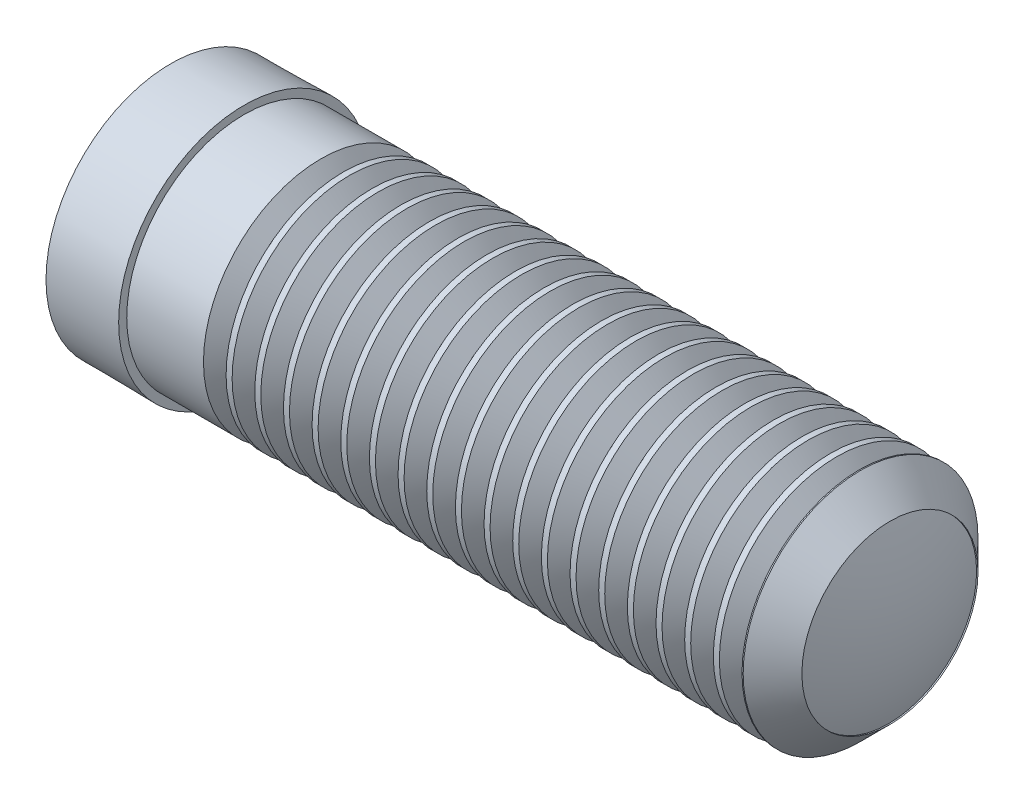
ISO-10303-21;
HEADER;
FILE_DESCRIPTION(('STEP AP214'),'2;1');
FILE_NAME('part.step','',(''),(''),'','','');
FILE_SCHEMA(('AUTOMOTIVE_DESIGN { 1 0 10303 214 1 1 1 1 }'));
ENDSEC;
DATA;
#1=APPLICATION_CONTEXT('core data for automotive mechanical design processes');
#2=APPLICATION_PROTOCOL_DEFINITION('international standard','automotive_design',2000,#1);
#3=PRODUCT_CONTEXT('',#1,'mechanical');
#4=PRODUCT('Part','Part','',(#3));
#5=PRODUCT_RELATED_PRODUCT_CATEGORY('part','',(#4));
#6=PRODUCT_DEFINITION_FORMATION('','',#4);
#7=PRODUCT_DEFINITION_CONTEXT('part definition',#1,'design');
#8=PRODUCT_DEFINITION('design','',#6,#7);
#9=PRODUCT_DEFINITION_SHAPE('','',#8);
#10=(LENGTH_UNIT() NAMED_UNIT(*) SI_UNIT(.MILLI.,.METRE.));
#11=(NAMED_UNIT(*) PLANE_ANGLE_UNIT() SI_UNIT($,.RADIAN.));
#12=(NAMED_UNIT(*) SI_UNIT($,.STERADIAN.) SOLID_ANGLE_UNIT());
#13=UNCERTAINTY_MEASURE_WITH_UNIT(LENGTH_MEASURE(1.E-05),#10,'distance_accuracy_value','');
#14=(GEOMETRIC_REPRESENTATION_CONTEXT(3) GLOBAL_UNCERTAINTY_ASSIGNED_CONTEXT((#13)) GLOBAL_UNIT_ASSIGNED_CONTEXT((#10,
#11,#12)) REPRESENTATION_CONTEXT('',''));
#15=CARTESIAN_POINT('',(0.,0.,0.));
#16=DIRECTION('',(0.,0.,1.));
#17=DIRECTION('',(1.,0.,0.));
#18=AXIS2_PLACEMENT_3D('',#15,#16,#17);
#19=CARTESIAN_POINT('',(-8.74032159186213,0.,0.));
#20=DIRECTION('',(-1.,0.,0.));
#21=DIRECTION('',(0.,0.,1.));
#22=AXIS2_PLACEMENT_3D('',#19,#20,#21);
#23=CYLINDRICAL_SURFACE('',#22,8.);
#24=CARTESIAN_POINT('',(44.9673570095025,0.,0.));
#25=DIRECTION('',(1.,0.,0.));
#26=DIRECTION('',(0.,0.,-1.));
#27=AXIS2_PLACEMENT_3D('',#24,#25,#26);
#28=CIRCLE('',#27,8.);
#29=CARTESIAN_POINT('',(44.9673570095025,0.,-8.));
#30=VERTEX_POINT('',#29);
#31=EDGE_CURVE('E169',#30,#30,#28,.F.);
#32=ORIENTED_EDGE('',*,*,#31,.F.);
#33=EDGE_LOOP('',(#32));
#34=FACE_BOUND('',#33,.T.);
#35=CARTESIAN_POINT('',(45.3775102973068,0.,0.));
#36=DIRECTION('',(-1.,0.,0.));
#37=DIRECTION('',(0.,0.,1.));
#38=AXIS2_PLACEMENT_3D('',#35,#36,#37);
#39=CIRCLE('',#38,8.);
#40=CARTESIAN_POINT('',(45.3775102973068,0.,8.));
#41=VERTEX_POINT('',#40);
#42=EDGE_CURVE('E172',#41,#41,#39,.F.);
#43=ORIENTED_EDGE('',*,*,#42,.F.);
#44=EDGE_LOOP('',(#43));
#45=FACE_BOUND('',#44,.T.);
#46=ADVANCED_FACE('F29',(#34,#45),#23,.T.);
#47=CARTESIAN_POINT('',(43.0146465150222,0.,0.));
#48=DIRECTION('',(1.,0.,0.));
#49=DIRECTION('',(0.,0.,-1.));
#50=AXIS2_PLACEMENT_3D('',#47,#48,#49);
#51=CIRCLE('',#50,8.);
#52=CARTESIAN_POINT('',(43.0146465150222,0.,-8.));
#53=VERTEX_POINT('',#52);
#54=EDGE_CURVE('E162',#53,#53,#51,.F.);
#55=ORIENTED_EDGE('',*,*,#54,.F.);
#56=EDGE_LOOP('',(#55));
#57=FACE_BOUND('',#56,.T.);
#58=CARTESIAN_POINT('',(43.4247998028265,0.,0.));
#59=DIRECTION('',(-1.,0.,0.));
#60=DIRECTION('',(0.,0.,1.));
#61=AXIS2_PLACEMENT_3D('',#58,#59,#60);
#62=CIRCLE('',#61,8.);
#63=CARTESIAN_POINT('',(43.4247998028265,0.,8.));
#64=VERTEX_POINT('',#63);
#65=EDGE_CURVE('E166',#64,#64,#62,.F.);
#66=ORIENTED_EDGE('',*,*,#65,.F.);
#67=EDGE_LOOP('',(#66));
#68=FACE_BOUND('',#67,.T.);
#69=ADVANCED_FACE('F246',(#57,#68),#23,.T.);
#70=CARTESIAN_POINT('',(41.061936020542,0.,0.));
#71=DIRECTION('',(1.,0.,0.));
#72=DIRECTION('',(0.,0.,-1.));
#73=AXIS2_PLACEMENT_3D('',#70,#71,#72);
#74=CIRCLE('',#73,8.);
#75=CARTESIAN_POINT('',(41.061936020542,0.,-8.));
#76=VERTEX_POINT('',#75);
#77=EDGE_CURVE('E155',#76,#76,#74,.F.);
#78=ORIENTED_EDGE('',*,*,#77,.F.);
#79=EDGE_LOOP('',(#78));
#80=FACE_BOUND('',#79,.T.);
#81=CARTESIAN_POINT('',(41.4720893083462,0.,0.));
#82=DIRECTION('',(-1.,0.,0.));
#83=DIRECTION('',(0.,0.,1.));
#84=AXIS2_PLACEMENT_3D('',#81,#82,#83);
#85=CIRCLE('',#84,8.);
#86=CARTESIAN_POINT('',(41.4720893083462,0.,8.));
#87=VERTEX_POINT('',#86);
#88=EDGE_CURVE('E159',#87,#87,#85,.F.);
#89=ORIENTED_EDGE('',*,*,#88,.F.);
#90=EDGE_LOOP('',(#89));
#91=FACE_BOUND('',#90,.T.);
#92=ADVANCED_FACE('F252',(#80,#91),#23,.T.);
#93=CARTESIAN_POINT('',(39.1092255260617,0.,0.));
#94=DIRECTION('',(1.,0.,0.));
#95=DIRECTION('',(0.,0.,-1.));
#96=AXIS2_PLACEMENT_3D('',#93,#94,#95);
#97=CIRCLE('',#96,8.);
#98=CARTESIAN_POINT('',(39.1092255260617,0.,-8.));
#99=VERTEX_POINT('',#98);
#100=EDGE_CURVE('E148',#99,#99,#97,.F.);
#101=ORIENTED_EDGE('',*,*,#100,.F.);
#102=EDGE_LOOP('',(#101));
#103=FACE_BOUND('',#102,.T.);
#104=CARTESIAN_POINT('',(39.519378813866,0.,0.));
#105=DIRECTION('',(-1.,0.,0.));
#106=DIRECTION('',(0.,0.,1.));
#107=AXIS2_PLACEMENT_3D('',#104,#105,#106);
#108=CIRCLE('',#107,8.);
#109=CARTESIAN_POINT('',(39.519378813866,0.,8.));
#110=VERTEX_POINT('',#109);
#111=EDGE_CURVE('E152',#110,#110,#108,.F.);
#112=ORIENTED_EDGE('',*,*,#111,.F.);
#113=EDGE_LOOP('',(#112));
#114=FACE_BOUND('',#113,.T.);
#115=ADVANCED_FACE('F739',(#103,#114),#23,.T.);
#116=CARTESIAN_POINT('',(37.1565150315814,0.,0.));
#117=DIRECTION('',(1.,0.,0.));
#118=DIRECTION('',(0.,0.,-1.));
#119=AXIS2_PLACEMENT_3D('',#116,#117,#118);
#120=CIRCLE('',#119,8.);
#121=CARTESIAN_POINT('',(37.1565150315814,0.,-8.));
#122=VERTEX_POINT('',#121);
#123=EDGE_CURVE('E141',#122,#122,#120,.F.);
#124=ORIENTED_EDGE('',*,*,#123,.F.);
#125=EDGE_LOOP('',(#124));
#126=FACE_BOUND('',#125,.T.);
#127=CARTESIAN_POINT('',(37.5666683193857,0.,0.));
#128=DIRECTION('',(-1.,0.,0.));
#129=DIRECTION('',(0.,0.,1.));
#130=AXIS2_PLACEMENT_3D('',#127,#128,#129);
#131=CIRCLE('',#130,8.);
#132=CARTESIAN_POINT('',(37.5666683193857,0.,8.));
#133=VERTEX_POINT('',#132);
#134=EDGE_CURVE('E145',#133,#133,#131,.F.);
#135=ORIENTED_EDGE('',*,*,#134,.F.);
#136=EDGE_LOOP('',(#135));
#137=FACE_BOUND('',#136,.T.);
#138=ADVANCED_FACE('F730',(#126,#137),#23,.T.);
#139=CARTESIAN_POINT('',(35.2038045371012,0.,0.));
#140=DIRECTION('',(1.,0.,0.));
#141=DIRECTION('',(0.,0.,-1.));
#142=AXIS2_PLACEMENT_3D('',#139,#140,#141);
#143=CIRCLE('',#142,8.);
#144=CARTESIAN_POINT('',(35.2038045371012,0.,-8.));
#145=VERTEX_POINT('',#144);
#146=EDGE_CURVE('E134',#145,#145,#143,.F.);
#147=ORIENTED_EDGE('',*,*,#146,.F.);
#148=EDGE_LOOP('',(#147));
#149=FACE_BOUND('',#148,.T.);
#150=CARTESIAN_POINT('',(35.6139578249054,0.,0.));
#151=DIRECTION('',(-1.,0.,0.));
#152=DIRECTION('',(0.,0.,1.));
#153=AXIS2_PLACEMENT_3D('',#150,#151,#152);
#154=CIRCLE('',#153,8.);
#155=CARTESIAN_POINT('',(35.6139578249054,0.,8.));
#156=VERTEX_POINT('',#155);
#157=EDGE_CURVE('E138',#156,#156,#154,.F.);
#158=ORIENTED_EDGE('',*,*,#157,.F.);
#159=EDGE_LOOP('',(#158));
#160=FACE_BOUND('',#159,.T.);
#161=ADVANCED_FACE('F721',(#149,#160),#23,.T.);
#162=CARTESIAN_POINT('',(33.2510940426209,0.,0.));
#163=DIRECTION('',(1.,0.,0.));
#164=DIRECTION('',(0.,0.,-1.));
#165=AXIS2_PLACEMENT_3D('',#162,#163,#164);
#166=CIRCLE('',#165,8.);
#167=CARTESIAN_POINT('',(33.2510940426209,0.,-8.));
#168=VERTEX_POINT('',#167);
#169=EDGE_CURVE('E127',#168,#168,#166,.F.);
#170=ORIENTED_EDGE('',*,*,#169,.F.);
#171=EDGE_LOOP('',(#170));
#172=FACE_BOUND('',#171,.T.);
#173=CARTESIAN_POINT('',(33.6612473304252,0.,0.));
#174=DIRECTION('',(-1.,0.,0.));
#175=DIRECTION('',(0.,0.,1.));
#176=AXIS2_PLACEMENT_3D('',#173,#174,#175);
#177=CIRCLE('',#176,8.);
#178=CARTESIAN_POINT('',(33.6612473304252,0.,8.));
#179=VERTEX_POINT('',#178);
#180=EDGE_CURVE('E131',#179,#179,#177,.F.);
#181=ORIENTED_EDGE('',*,*,#180,.F.);
#182=EDGE_LOOP('',(#181));
#183=FACE_BOUND('',#182,.T.);
#184=ADVANCED_FACE('F712',(#172,#183),#23,.T.);
#185=CARTESIAN_POINT('',(31.2983835481406,0.,0.));
#186=DIRECTION('',(1.,0.,0.));
#187=DIRECTION('',(0.,0.,-1.));
#188=AXIS2_PLACEMENT_3D('',#185,#186,#187);
#189=CIRCLE('',#188,8.);
#190=CARTESIAN_POINT('',(31.2983835481406,0.,-8.));
#191=VERTEX_POINT('',#190);
#192=EDGE_CURVE('E120',#191,#191,#189,.F.);
#193=ORIENTED_EDGE('',*,*,#192,.F.);
#194=EDGE_LOOP('',(#193));
#195=FACE_BOUND('',#194,.T.);
#196=CARTESIAN_POINT('',(31.7085368359449,0.,0.));
#197=DIRECTION('',(-1.,0.,0.));
#198=DIRECTION('',(0.,0.,1.));
#199=AXIS2_PLACEMENT_3D('',#196,#197,#198);
#200=CIRCLE('',#199,8.);
#201=CARTESIAN_POINT('',(31.7085368359449,0.,8.));
#202=VERTEX_POINT('',#201);
#203=EDGE_CURVE('E124',#202,#202,#200,.F.);
#204=ORIENTED_EDGE('',*,*,#203,.F.);
#205=EDGE_LOOP('',(#204));
#206=FACE_BOUND('',#205,.T.);
#207=ADVANCED_FACE('F703',(#195,#206),#23,.T.);
#208=CARTESIAN_POINT('',(29.3456730536604,0.,0.));
#209=DIRECTION('',(1.,0.,0.));
#210=DIRECTION('',(0.,0.,-1.));
#211=AXIS2_PLACEMENT_3D('',#208,#209,#210);
#212=CIRCLE('',#211,8.);
#213=CARTESIAN_POINT('',(29.3456730536604,0.,-8.));
#214=VERTEX_POINT('',#213);
#215=EDGE_CURVE('E113',#214,#214,#212,.F.);
#216=ORIENTED_EDGE('',*,*,#215,.F.);
#217=EDGE_LOOP('',(#216));
#218=FACE_BOUND('',#217,.T.);
#219=CARTESIAN_POINT('',(29.7558263414646,0.,0.));
#220=DIRECTION('',(-1.,0.,0.));
#221=DIRECTION('',(0.,0.,1.));
#222=AXIS2_PLACEMENT_3D('',#219,#220,#221);
#223=CIRCLE('',#222,8.);
#224=CARTESIAN_POINT('',(29.7558263414646,0.,8.));
#225=VERTEX_POINT('',#224);
#226=EDGE_CURVE('E117',#225,#225,#223,.F.);
#227=ORIENTED_EDGE('',*,*,#226,.F.);
#228=EDGE_LOOP('',(#227));
#229=FACE_BOUND('',#228,.T.);
#230=ADVANCED_FACE('F694',(#218,#229),#23,.T.);
#231=CARTESIAN_POINT('',(27.3929625591801,0.,0.));
#232=DIRECTION('',(1.,0.,0.));
#233=DIRECTION('',(0.,0.,-1.));
#234=AXIS2_PLACEMENT_3D('',#231,#232,#233);
#235=CIRCLE('',#234,8.);
#236=CARTESIAN_POINT('',(27.3929625591801,0.,-8.));
#237=VERTEX_POINT('',#236);
#238=EDGE_CURVE('E106',#237,#237,#235,.F.);
#239=ORIENTED_EDGE('',*,*,#238,.F.);
#240=EDGE_LOOP('',(#239));
#241=FACE_BOUND('',#240,.T.);
#242=CARTESIAN_POINT('',(27.8031158469844,0.,0.));
#243=DIRECTION('',(-1.,0.,0.));
#244=DIRECTION('',(0.,0.,1.));
#245=AXIS2_PLACEMENT_3D('',#242,#243,#244);
#246=CIRCLE('',#245,8.);
#247=CARTESIAN_POINT('',(27.8031158469844,0.,8.));
#248=VERTEX_POINT('',#247);
#249=EDGE_CURVE('E110',#248,#248,#246,.F.);
#250=ORIENTED_EDGE('',*,*,#249,.F.);
#251=EDGE_LOOP('',(#250));
#252=FACE_BOUND('',#251,.T.);
#253=ADVANCED_FACE('F685',(#241,#252),#23,.T.);
#254=CARTESIAN_POINT('',(25.4402520646999,0.,0.));
#255=DIRECTION('',(1.,0.,0.));
#256=DIRECTION('',(0.,0.,-1.));
#257=AXIS2_PLACEMENT_3D('',#254,#255,#256);
#258=CIRCLE('',#257,8.);
#259=CARTESIAN_POINT('',(25.4402520646999,0.,-8.));
#260=VERTEX_POINT('',#259);
#261=EDGE_CURVE('E99',#260,#260,#258,.F.);
#262=ORIENTED_EDGE('',*,*,#261,.F.);
#263=EDGE_LOOP('',(#262));
#264=FACE_BOUND('',#263,.T.);
#265=CARTESIAN_POINT('',(25.8504053525041,0.,0.));
#266=DIRECTION('',(-1.,0.,0.));
#267=DIRECTION('',(0.,0.,1.));
#268=AXIS2_PLACEMENT_3D('',#265,#266,#267);
#269=CIRCLE('',#268,8.);
#270=CARTESIAN_POINT('',(25.8504053525041,0.,8.));
#271=VERTEX_POINT('',#270);
#272=EDGE_CURVE('E103',#271,#271,#269,.F.);
#273=ORIENTED_EDGE('',*,*,#272,.F.);
#274=EDGE_LOOP('',(#273));
#275=FACE_BOUND('',#274,.T.);
#276=ADVANCED_FACE('F676',(#264,#275),#23,.T.);
#277=CARTESIAN_POINT('',(23.4875415702196,0.,0.));
#278=DIRECTION('',(1.,0.,0.));
#279=DIRECTION('',(0.,0.,-1.));
#280=AXIS2_PLACEMENT_3D('',#277,#278,#279);
#281=CIRCLE('',#280,8.);
#282=CARTESIAN_POINT('',(23.4875415702196,0.,-8.));
#283=VERTEX_POINT('',#282);
#284=EDGE_CURVE('E92',#283,#283,#281,.F.);
#285=ORIENTED_EDGE('',*,*,#284,.F.);
#286=EDGE_LOOP('',(#285));
#287=FACE_BOUND('',#286,.T.);
#288=CARTESIAN_POINT('',(23.8976948580239,0.,0.));
#289=DIRECTION('',(-1.,0.,0.));
#290=DIRECTION('',(0.,0.,1.));
#291=AXIS2_PLACEMENT_3D('',#288,#289,#290);
#292=CIRCLE('',#291,8.);
#293=CARTESIAN_POINT('',(23.8976948580239,0.,8.));
#294=VERTEX_POINT('',#293);
#295=EDGE_CURVE('E96',#294,#294,#292,.F.);
#296=ORIENTED_EDGE('',*,*,#295,.F.);
#297=EDGE_LOOP('',(#296));
#298=FACE_BOUND('',#297,.T.);
#299=ADVANCED_FACE('F667',(#287,#298),#23,.T.);
#300=CARTESIAN_POINT('',(21.5348310757393,0.,0.));
#301=DIRECTION('',(1.,0.,0.));
#302=DIRECTION('',(0.,0.,-1.));
#303=AXIS2_PLACEMENT_3D('',#300,#301,#302);
#304=CIRCLE('',#303,8.);
#305=CARTESIAN_POINT('',(21.5348310757393,0.,-8.));
#306=VERTEX_POINT('',#305);
#307=EDGE_CURVE('E85',#306,#306,#304,.F.);
#308=ORIENTED_EDGE('',*,*,#307,.F.);
#309=EDGE_LOOP('',(#308));
#310=FACE_BOUND('',#309,.T.);
#311=CARTESIAN_POINT('',(21.9449843635436,0.,0.));
#312=DIRECTION('',(-1.,0.,0.));
#313=DIRECTION('',(0.,0.,1.));
#314=AXIS2_PLACEMENT_3D('',#311,#312,#313);
#315=CIRCLE('',#314,8.);
#316=CARTESIAN_POINT('',(21.9449843635436,0.,8.));
#317=VERTEX_POINT('',#316);
#318=EDGE_CURVE('E89',#317,#317,#315,.F.);
#319=ORIENTED_EDGE('',*,*,#318,.F.);
#320=EDGE_LOOP('',(#319));
#321=FACE_BOUND('',#320,.T.);
#322=ADVANCED_FACE('F658',(#310,#321),#23,.T.);
#323=CARTESIAN_POINT('',(19.5821205812591,0.,0.));
#324=DIRECTION('',(1.,0.,0.));
#325=DIRECTION('',(0.,0.,-1.));
#326=AXIS2_PLACEMENT_3D('',#323,#324,#325);
#327=CIRCLE('',#326,8.);
#328=CARTESIAN_POINT('',(19.5821205812591,0.,-8.));
#329=VERTEX_POINT('',#328);
#330=EDGE_CURVE('E78',#329,#329,#327,.F.);
#331=ORIENTED_EDGE('',*,*,#330,.F.);
#332=EDGE_LOOP('',(#331));
#333=FACE_BOUND('',#332,.T.);
#334=CARTESIAN_POINT('',(19.9922738690633,0.,0.));
#335=DIRECTION('',(-1.,0.,0.));
#336=DIRECTION('',(0.,0.,1.));
#337=AXIS2_PLACEMENT_3D('',#334,#335,#336);
#338=CIRCLE('',#337,8.);
#339=CARTESIAN_POINT('',(19.9922738690633,0.,8.));
#340=VERTEX_POINT('',#339);
#341=EDGE_CURVE('E82',#340,#340,#338,.F.);
#342=ORIENTED_EDGE('',*,*,#341,.F.);
#343=EDGE_LOOP('',(#342));
#344=FACE_BOUND('',#343,.T.);
#345=ADVANCED_FACE('F649',(#333,#344),#23,.T.);
#346=CARTESIAN_POINT('',(17.6294100867788,0.,0.));
#347=DIRECTION('',(1.,0.,0.));
#348=DIRECTION('',(0.,0.,-1.));
#349=AXIS2_PLACEMENT_3D('',#346,#347,#348);
#350=CIRCLE('',#349,8.);
#351=CARTESIAN_POINT('',(17.6294100867788,0.,-8.));
#352=VERTEX_POINT('',#351);
#353=EDGE_CURVE('E71',#352,#352,#350,.F.);
#354=ORIENTED_EDGE('',*,*,#353,.F.);
#355=EDGE_LOOP('',(#354));
#356=FACE_BOUND('',#355,.T.);
#357=CARTESIAN_POINT('',(18.0395633745831,0.,0.));
#358=DIRECTION('',(-1.,0.,0.));
#359=DIRECTION('',(0.,0.,1.));
#360=AXIS2_PLACEMENT_3D('',#357,#358,#359);
#361=CIRCLE('',#360,8.);
#362=CARTESIAN_POINT('',(18.0395633745831,0.,8.));
#363=VERTEX_POINT('',#362);
#364=EDGE_CURVE('E75',#363,#363,#361,.F.);
#365=ORIENTED_EDGE('',*,*,#364,.F.);
#366=EDGE_LOOP('',(#365));
#367=FACE_BOUND('',#366,.T.);
#368=ADVANCED_FACE('F640',(#356,#367),#23,.T.);
#369=CARTESIAN_POINT('',(15.6766995922985,0.,0.));
#370=DIRECTION('',(1.,0.,0.));
#371=DIRECTION('',(0.,0.,-1.));
#372=AXIS2_PLACEMENT_3D('',#369,#370,#371);
#373=CIRCLE('',#372,8.);
#374=CARTESIAN_POINT('',(15.6766995922985,0.,-8.));
#375=VERTEX_POINT('',#374);
#376=EDGE_CURVE('E64',#375,#375,#373,.F.);
#377=ORIENTED_EDGE('',*,*,#376,.F.);
#378=EDGE_LOOP('',(#377));
#379=FACE_BOUND('',#378,.T.);
#380=CARTESIAN_POINT('',(16.0868528801028,0.,0.));
#381=DIRECTION('',(-1.,0.,0.));
#382=DIRECTION('',(0.,0.,1.));
#383=AXIS2_PLACEMENT_3D('',#380,#381,#382);
#384=CIRCLE('',#383,8.);
#385=CARTESIAN_POINT('',(16.0868528801028,0.,8.));
#386=VERTEX_POINT('',#385);
#387=EDGE_CURVE('E68',#386,#386,#384,.F.);
#388=ORIENTED_EDGE('',*,*,#387,.F.);
#389=EDGE_LOOP('',(#388));
#390=FACE_BOUND('',#389,.T.);
#391=ADVANCED_FACE('F288',(#379,#390),#23,.T.);
#392=CARTESIAN_POINT('',(13.7239890978183,0.,0.));
#393=DIRECTION('',(1.,0.,0.));
#394=DIRECTION('',(0.,0.,-1.));
#395=AXIS2_PLACEMENT_3D('',#392,#393,#394);
#396=CIRCLE('',#395,8.);
#397=CARTESIAN_POINT('',(13.7239890978183,0.,-8.));
#398=VERTEX_POINT('',#397);
#399=EDGE_CURVE('E57',#398,#398,#396,.F.);
#400=ORIENTED_EDGE('',*,*,#399,.F.);
#401=EDGE_LOOP('',(#400));
#402=FACE_BOUND('',#401,.T.);
#403=CARTESIAN_POINT('',(14.1341423856225,0.,0.));
#404=DIRECTION('',(-1.,0.,0.));
#405=DIRECTION('',(0.,0.,1.));
#406=AXIS2_PLACEMENT_3D('',#403,#404,#405);
#407=CIRCLE('',#406,8.);
#408=CARTESIAN_POINT('',(14.1341423856225,0.,8.));
#409=VERTEX_POINT('',#408);
#410=EDGE_CURVE('E61',#409,#409,#407,.F.);
#411=ORIENTED_EDGE('',*,*,#410,.F.);
#412=EDGE_LOOP('',(#411));
#413=FACE_BOUND('',#412,.T.);
#414=ADVANCED_FACE('F279',(#402,#413),#23,.T.);
#415=CARTESIAN_POINT('',(11.771278603338,0.,0.));
#416=DIRECTION('',(1.,0.,0.));
#417=DIRECTION('',(0.,0.,-1.));
#418=AXIS2_PLACEMENT_3D('',#415,#416,#417);
#419=CIRCLE('',#418,8.);
#420=CARTESIAN_POINT('',(11.771278603338,0.,-8.));
#421=VERTEX_POINT('',#420);
#422=EDGE_CURVE('E49',#421,#421,#419,.F.);
#423=ORIENTED_EDGE('',*,*,#422,.F.);
#424=EDGE_LOOP('',(#423));
#425=FACE_BOUND('',#424,.T.);
#426=CARTESIAN_POINT('',(12.1814318911423,0.,0.));
#427=DIRECTION('',(-1.,0.,0.));
#428=DIRECTION('',(0.,0.,1.));
#429=AXIS2_PLACEMENT_3D('',#426,#427,#428);
#430=CIRCLE('',#429,8.);
#431=CARTESIAN_POINT('',(12.1814318911423,0.,8.));
#432=VERTEX_POINT('',#431);
#433=EDGE_CURVE('E54',#432,#432,#430,.F.);
#434=ORIENTED_EDGE('',*,*,#433,.F.);
#435=EDGE_LOOP('',(#434));
#436=FACE_BOUND('',#435,.T.);
#437=ADVANCED_FACE('F265',(#425,#436),#23,.T.);
#438=CARTESIAN_POINT('',(11.,0.,0.));
#439=DIRECTION('',(1.,0.,0.));
#440=DIRECTION('',(0.,0.,-1.));
#441=AXIS2_PLACEMENT_3D('',#438,#439,#440);
#442=CONICAL_SURFACE('',#441,6.8985,0.959931088596878);
#443=CARTESIAN_POINT('',(11.,0.,0.));
#444=DIRECTION('',(-1.,0.,0.));
#445=DIRECTION('',(0.,0.,1.));
#446=AXIS2_PLACEMENT_3D('',#443,#444,#445);
#447=CIRCLE('',#446,6.8985);
#448=CARTESIAN_POINT('',(11.,0.,6.8985));
#449=VERTEX_POINT('',#448);
#450=EDGE_CURVE('E50',#449,#449,#447,.T.);
#451=ORIENTED_EDGE('',*,*,#450,.F.);
#452=EDGE_LOOP('',(#451));
#453=FACE_BOUND('',#452,.T.);
#454=ORIENTED_EDGE('',*,*,#422,.T.);
#455=EDGE_LOOP('',(#454));
#456=FACE_BOUND('',#455,.T.);
#457=ADVANCED_FACE('F278',(#453,#456),#442,.T.);
#458=CARTESIAN_POINT('',(10.1937110197515,0.,0.));
#459=DIRECTION('',(-1.,0.,0.));
#460=DIRECTION('',(0.,0.,1.));
#461=AXIS2_PLACEMENT_3D('',#458,#459,#460);
#462=CONICAL_SURFACE('',#461,8.04999999999999,0.959931088596878);
#463=ORIENTED_EDGE('',*,*,#450,.T.);
#464=EDGE_LOOP('',(#463));
#465=FACE_BOUND('',#464,.T.);
#466=CARTESIAN_POINT('',(10.228721396662,0.,0.));
#467=DIRECTION('',(-1.,0.,0.));
#468=DIRECTION('',(0.,0.,1.));
#469=AXIS2_PLACEMENT_3D('',#466,#467,#468);
#470=CIRCLE('',#469,8.);
#471=CARTESIAN_POINT('',(10.228721396662,0.,8.));
#472=VERTEX_POINT('',#471);
#473=EDGE_CURVE('E46',#472,#472,#470,.F.);
#474=ORIENTED_EDGE('',*,*,#473,.T.);
#475=EDGE_LOOP('',(#474));
#476=FACE_BOUND('',#475,.T.);
#477=ADVANCED_FACE('F285',(#465,#476),#462,.T.);
#478=CARTESIAN_POINT('',(0.,0.,0.));
#479=DIRECTION('',(1.,0.,0.));
#480=DIRECTION('',(0.,0.,-1.));
#481=AXIS2_PLACEMENT_3D('',#478,#479,#480);
#482=PLANE('',#481);
#483=CARTESIAN_POINT('',(0.,0.,0.));
#484=DIRECTION('',(-1.,0.,0.));
#485=DIRECTION('',(0.,0.,1.));
#486=AXIS2_PLACEMENT_3D('',#483,#484,#485);
#487=CIRCLE('',#486,8.5);
#488=CARTESIAN_POINT('',(0.,0.,8.5));
#489=VERTEX_POINT('',#488);
#490=EDGE_CURVE('E53',#489,#489,#487,.T.);
#491=ORIENTED_EDGE('',*,*,#490,.T.);
#492=EDGE_LOOP('',(#491));
#493=FACE_BOUND('',#492,.T.);
#494=ADVANCED_FACE('F307',(#493),#482,.F.);
#495=CARTESIAN_POINT('',(5.,0.,0.));
#496=DIRECTION('',(1.,0.,0.));
#497=DIRECTION('',(0.,0.,-1.));
#498=AXIS2_PLACEMENT_3D('',#495,#496,#497);
#499=CONICAL_SURFACE('',#498,8.54999999994035,0.00999966667473667);
#500=ORIENTED_EDGE('',*,*,#490,.F.);
#501=EDGE_LOOP('',(#500));
#502=FACE_BOUND('',#501,.T.);
#503=CARTESIAN_POINT('',(5.,0.,0.));
#504=DIRECTION('',(-1.,0.,0.));
#505=DIRECTION('',(0.,0.,1.));
#506=AXIS2_PLACEMENT_3D('',#503,#504,#505);
#507=CIRCLE('',#506,8.54999999994035);
#508=CARTESIAN_POINT('',(5.,0.,8.54999999994035));
#509=VERTEX_POINT('',#508);
#510=EDGE_CURVE('E221',#509,#509,#507,.T.);
#511=ORIENTED_EDGE('',*,*,#510,.T.);
#512=EDGE_LOOP('',(#511));
#513=FACE_BOUND('',#512,.T.);
#514=ADVANCED_FACE('F273',(#502,#513),#499,.T.);
#515=CARTESIAN_POINT('',(5.,8.54999999994035,0.));
#516=DIRECTION('',(-1.,0.,0.));
#517=DIRECTION('',(0.,0.,1.));
#518=AXIS2_PLACEMENT_3D('',#515,#516,#517);
#519=PLANE('',#518);
#520=ORIENTED_EDGE('',*,*,#510,.F.);
#521=EDGE_LOOP('',(#520));
#522=FACE_BOUND('',#521,.T.);
#523=CARTESIAN_POINT('',(5.,0.,0.));
#524=DIRECTION('',(-1.,0.,0.));
#525=DIRECTION('',(0.,0.,1.));
#526=AXIS2_PLACEMENT_3D('',#523,#524,#525);
#527=CIRCLE('',#526,8.);
#528=CARTESIAN_POINT('',(5.,0.,8.));
#529=VERTEX_POINT('',#528);
#530=EDGE_CURVE('E224',#529,#529,#527,.T.);
#531=ORIENTED_EDGE('',*,*,#530,.T.);
#532=EDGE_LOOP('',(#531));
#533=FACE_BOUND('',#532,.T.);
#534=ADVANCED_FACE('F263',(#522,#533),#519,.F.);
#535=ORIENTED_EDGE('',*,*,#530,.F.);
#536=EDGE_LOOP('',(#535));
#537=FACE_BOUND('',#536,.T.);
#538=ORIENTED_EDGE('',*,*,#473,.F.);
#539=EDGE_LOOP('',(#538));
#540=FACE_BOUND('',#539,.T.);
#541=ADVANCED_FACE('F258',(#537,#540),#23,.T.);
#542=CARTESIAN_POINT('',(12.9527104944803,0.,0.));
#543=DIRECTION('',(1.,0.,0.));
#544=DIRECTION('',(0.,0.,-1.));
#545=AXIS2_PLACEMENT_3D('',#542,#543,#544);
#546=CONICAL_SURFACE('',#545,6.8985,0.959931088596878);
#547=CARTESIAN_POINT('',(12.9527104944803,0.,0.));
#548=DIRECTION('',(-1.,0.,0.));
#549=DIRECTION('',(0.,0.,1.));
#550=AXIS2_PLACEMENT_3D('',#547,#548,#549);
#551=CIRCLE('',#550,6.8985);
#552=CARTESIAN_POINT('',(12.9527104944803,0.,6.8985));
#553=VERTEX_POINT('',#552);
#554=EDGE_CURVE('E58',#553,#553,#551,.T.);
#555=ORIENTED_EDGE('',*,*,#554,.F.);
#556=EDGE_LOOP('',(#555));
#557=FACE_BOUND('',#556,.T.);
#558=ORIENTED_EDGE('',*,*,#399,.T.);
#559=EDGE_LOOP('',(#558));
#560=FACE_BOUND('',#559,.T.);
#561=ADVANCED_FACE('F262',(#557,#560),#546,.T.);
#562=CARTESIAN_POINT('',(12.1464215142318,0.,0.));
#563=DIRECTION('',(-1.,0.,0.));
#564=DIRECTION('',(0.,0.,1.));
#565=AXIS2_PLACEMENT_3D('',#562,#563,#564);
#566=CONICAL_SURFACE('',#565,8.04999999999999,0.959931088596878);
#567=ORIENTED_EDGE('',*,*,#554,.T.);
#568=EDGE_LOOP('',(#567));
#569=FACE_BOUND('',#568,.T.);
#570=ORIENTED_EDGE('',*,*,#433,.T.);
#571=EDGE_LOOP('',(#570));
#572=FACE_BOUND('',#571,.T.);
#573=ADVANCED_FACE('F270',(#569,#572),#566,.T.);
#574=CARTESIAN_POINT('',(14.9054209889605,0.,0.));
#575=DIRECTION('',(1.,0.,0.));
#576=DIRECTION('',(0.,0.,-1.));
#577=AXIS2_PLACEMENT_3D('',#574,#575,#576);
#578=CONICAL_SURFACE('',#577,6.8985,0.959931088596878);
#579=CARTESIAN_POINT('',(14.9054209889605,0.,0.));
#580=DIRECTION('',(-1.,0.,0.));
#581=DIRECTION('',(0.,0.,1.));
#582=AXIS2_PLACEMENT_3D('',#579,#580,#581);
#583=CIRCLE('',#582,6.8985);
#584=CARTESIAN_POINT('',(14.9054209889605,0.,6.8985));
#585=VERTEX_POINT('',#584);
#586=EDGE_CURVE('E65',#585,#585,#583,.T.);
#587=ORIENTED_EDGE('',*,*,#586,.F.);
#588=EDGE_LOOP('',(#587));
#589=FACE_BOUND('',#588,.T.);
#590=ORIENTED_EDGE('',*,*,#376,.T.);
#591=EDGE_LOOP('',(#590));
#592=FACE_BOUND('',#591,.T.);
#593=ADVANCED_FACE('F295',(#589,#592),#578,.T.);
#594=CARTESIAN_POINT('',(14.0991320087121,0.,0.));
#595=DIRECTION('',(-1.,0.,0.));
#596=DIRECTION('',(0.,0.,1.));
#597=AXIS2_PLACEMENT_3D('',#594,#595,#596);
#598=CONICAL_SURFACE('',#597,8.04999999999999,0.959931088596878);
#599=ORIENTED_EDGE('',*,*,#586,.T.);
#600=EDGE_LOOP('',(#599));
#601=FACE_BOUND('',#600,.T.);
#602=ORIENTED_EDGE('',*,*,#410,.T.);
#603=EDGE_LOOP('',(#602));
#604=FACE_BOUND('',#603,.T.);
#605=ADVANCED_FACE('F301',(#601,#604),#598,.T.);
#606=CARTESIAN_POINT('',(16.8581314834408,0.,0.));
#607=DIRECTION('',(1.,0.,0.));
#608=DIRECTION('',(0.,0.,-1.));
#609=AXIS2_PLACEMENT_3D('',#606,#607,#608);
#610=CONICAL_SURFACE('',#609,6.8985,0.959931088596878);
#611=CARTESIAN_POINT('',(16.8581314834408,0.,0.));
#612=DIRECTION('',(-1.,0.,0.));
#613=DIRECTION('',(0.,0.,1.));
#614=AXIS2_PLACEMENT_3D('',#611,#612,#613);
#615=CIRCLE('',#614,6.8985);
#616=CARTESIAN_POINT('',(16.8581314834408,0.,6.8985));
#617=VERTEX_POINT('',#616);
#618=EDGE_CURVE('E72',#617,#617,#615,.T.);
#619=ORIENTED_EDGE('',*,*,#618,.F.);
#620=EDGE_LOOP('',(#619));
#621=FACE_BOUND('',#620,.T.);
#622=ORIENTED_EDGE('',*,*,#353,.T.);
#623=EDGE_LOOP('',(#622));
#624=FACE_BOUND('',#623,.T.);
#625=ADVANCED_FACE('F590',(#621,#624),#610,.T.);
#626=CARTESIAN_POINT('',(16.0518425031923,0.,0.));
#627=DIRECTION('',(-1.,0.,0.));
#628=DIRECTION('',(0.,0.,1.));
#629=AXIS2_PLACEMENT_3D('',#626,#627,#628);
#630=CONICAL_SURFACE('',#629,8.04999999999999,0.959931088596878);
#631=ORIENTED_EDGE('',*,*,#618,.T.);
#632=EDGE_LOOP('',(#631));
#633=FACE_BOUND('',#632,.T.);
#634=ORIENTED_EDGE('',*,*,#387,.T.);
#635=EDGE_LOOP('',(#634));
#636=FACE_BOUND('',#635,.T.);
#637=ADVANCED_FACE('F582',(#633,#636),#630,.T.);
#638=CARTESIAN_POINT('',(18.8108419779211,0.,0.));
#639=DIRECTION('',(1.,0.,0.));
#640=DIRECTION('',(0.,0.,-1.));
#641=AXIS2_PLACEMENT_3D('',#638,#639,#640);
#642=CONICAL_SURFACE('',#641,6.8985,0.959931088596878);
#643=CARTESIAN_POINT('',(18.8108419779211,0.,0.));
#644=DIRECTION('',(-1.,0.,0.));
#645=DIRECTION('',(0.,0.,1.));
#646=AXIS2_PLACEMENT_3D('',#643,#644,#645);
#647=CIRCLE('',#646,6.8985);
#648=CARTESIAN_POINT('',(18.8108419779211,0.,6.8985));
#649=VERTEX_POINT('',#648);
#650=EDGE_CURVE('E79',#649,#649,#647,.T.);
#651=ORIENTED_EDGE('',*,*,#650,.F.);
#652=EDGE_LOOP('',(#651));
#653=FACE_BOUND('',#652,.T.);
#654=ORIENTED_EDGE('',*,*,#330,.T.);
#655=EDGE_LOOP('',(#654));
#656=FACE_BOUND('',#655,.T.);
#657=ADVANCED_FACE('F574',(#653,#656),#642,.T.);
#658=CARTESIAN_POINT('',(18.0045529976726,0.,0.));
#659=DIRECTION('',(-1.,0.,0.));
#660=DIRECTION('',(0.,0.,1.));
#661=AXIS2_PLACEMENT_3D('',#658,#659,#660);
#662=CONICAL_SURFACE('',#661,8.04999999999999,0.959931088596878);
#663=ORIENTED_EDGE('',*,*,#650,.T.);
#664=EDGE_LOOP('',(#663));
#665=FACE_BOUND('',#664,.T.);
#666=ORIENTED_EDGE('',*,*,#364,.T.);
#667=EDGE_LOOP('',(#666));
#668=FACE_BOUND('',#667,.T.);
#669=ADVANCED_FACE('F566',(#665,#668),#662,.T.);
#670=CARTESIAN_POINT('',(20.7635524724013,0.,0.));
#671=DIRECTION('',(1.,0.,0.));
#672=DIRECTION('',(0.,0.,-1.));
#673=AXIS2_PLACEMENT_3D('',#670,#671,#672);
#674=CONICAL_SURFACE('',#673,6.8985,0.959931088596878);
#675=CARTESIAN_POINT('',(20.7635524724013,0.,0.));
#676=DIRECTION('',(-1.,0.,0.));
#677=DIRECTION('',(0.,0.,1.));
#678=AXIS2_PLACEMENT_3D('',#675,#676,#677);
#679=CIRCLE('',#678,6.8985);
#680=CARTESIAN_POINT('',(20.7635524724013,0.,6.8985));
#681=VERTEX_POINT('',#680);
#682=EDGE_CURVE('E86',#681,#681,#679,.T.);
#683=ORIENTED_EDGE('',*,*,#682,.F.);
#684=EDGE_LOOP('',(#683));
#685=FACE_BOUND('',#684,.T.);
#686=ORIENTED_EDGE('',*,*,#307,.T.);
#687=EDGE_LOOP('',(#686));
#688=FACE_BOUND('',#687,.T.);
#689=ADVANCED_FACE('F558',(#685,#688),#674,.T.);
#690=CARTESIAN_POINT('',(19.9572634921528,0.,0.));
#691=DIRECTION('',(-1.,0.,0.));
#692=DIRECTION('',(0.,0.,1.));
#693=AXIS2_PLACEMENT_3D('',#690,#691,#692);
#694=CONICAL_SURFACE('',#693,8.04999999999999,0.959931088596878);
#695=ORIENTED_EDGE('',*,*,#682,.T.);
#696=EDGE_LOOP('',(#695));
#697=FACE_BOUND('',#696,.T.);
#698=ORIENTED_EDGE('',*,*,#341,.T.);
#699=EDGE_LOOP('',(#698));
#700=FACE_BOUND('',#699,.T.);
#701=ADVANCED_FACE('F550',(#697,#700),#694,.T.);
#702=CARTESIAN_POINT('',(22.7162629668816,0.,0.));
#703=DIRECTION('',(1.,0.,0.));
#704=DIRECTION('',(0.,0.,-1.));
#705=AXIS2_PLACEMENT_3D('',#702,#703,#704);
#706=CONICAL_SURFACE('',#705,6.8985,0.959931088596878);
#707=CARTESIAN_POINT('',(22.7162629668816,0.,0.));
#708=DIRECTION('',(-1.,0.,0.));
#709=DIRECTION('',(0.,0.,1.));
#710=AXIS2_PLACEMENT_3D('',#707,#708,#709);
#711=CIRCLE('',#710,6.8985);
#712=CARTESIAN_POINT('',(22.7162629668816,0.,6.8985));
#713=VERTEX_POINT('',#712);
#714=EDGE_CURVE('E93',#713,#713,#711,.T.);
#715=ORIENTED_EDGE('',*,*,#714,.F.);
#716=EDGE_LOOP('',(#715));
#717=FACE_BOUND('',#716,.T.);
#718=ORIENTED_EDGE('',*,*,#284,.T.);
#719=EDGE_LOOP('',(#718));
#720=FACE_BOUND('',#719,.T.);
#721=ADVANCED_FACE('F542',(#717,#720),#706,.T.);
#722=CARTESIAN_POINT('',(21.9099739866331,0.,0.));
#723=DIRECTION('',(-1.,0.,0.));
#724=DIRECTION('',(0.,0.,1.));
#725=AXIS2_PLACEMENT_3D('',#722,#723,#724);
#726=CONICAL_SURFACE('',#725,8.04999999999999,0.959931088596878);
#727=ORIENTED_EDGE('',*,*,#714,.T.);
#728=EDGE_LOOP('',(#727));
#729=FACE_BOUND('',#728,.T.);
#730=ORIENTED_EDGE('',*,*,#318,.T.);
#731=EDGE_LOOP('',(#730));
#732=FACE_BOUND('',#731,.T.);
#733=ADVANCED_FACE('F534',(#729,#732),#726,.T.);
#734=CARTESIAN_POINT('',(24.6689734613619,0.,0.));
#735=DIRECTION('',(1.,0.,0.));
#736=DIRECTION('',(0.,0.,-1.));
#737=AXIS2_PLACEMENT_3D('',#734,#735,#736);
#738=CONICAL_SURFACE('',#737,6.8985,0.959931088596878);
#739=CARTESIAN_POINT('',(24.6689734613619,0.,0.));
#740=DIRECTION('',(-1.,0.,0.));
#741=DIRECTION('',(0.,0.,1.));
#742=AXIS2_PLACEMENT_3D('',#739,#740,#741);
#743=CIRCLE('',#742,6.8985);
#744=CARTESIAN_POINT('',(24.6689734613619,0.,6.8985));
#745=VERTEX_POINT('',#744);
#746=EDGE_CURVE('E100',#745,#745,#743,.T.);
#747=ORIENTED_EDGE('',*,*,#746,.F.);
#748=EDGE_LOOP('',(#747));
#749=FACE_BOUND('',#748,.T.);
#750=ORIENTED_EDGE('',*,*,#261,.T.);
#751=EDGE_LOOP('',(#750));
#752=FACE_BOUND('',#751,.T.);
#753=ADVANCED_FACE('F526',(#749,#752),#738,.T.);
#754=CARTESIAN_POINT('',(23.8626844811134,0.,0.));
#755=DIRECTION('',(-1.,0.,0.));
#756=DIRECTION('',(0.,0.,1.));
#757=AXIS2_PLACEMENT_3D('',#754,#755,#756);
#758=CONICAL_SURFACE('',#757,8.04999999999999,0.959931088596878);
#759=ORIENTED_EDGE('',*,*,#746,.T.);
#760=EDGE_LOOP('',(#759));
#761=FACE_BOUND('',#760,.T.);
#762=ORIENTED_EDGE('',*,*,#295,.T.);
#763=EDGE_LOOP('',(#762));
#764=FACE_BOUND('',#763,.T.);
#765=ADVANCED_FACE('F518',(#761,#764),#758,.T.);
#766=CARTESIAN_POINT('',(26.6216839558421,0.,0.));
#767=DIRECTION('',(1.,0.,0.));
#768=DIRECTION('',(0.,0.,-1.));
#769=AXIS2_PLACEMENT_3D('',#766,#767,#768);
#770=CONICAL_SURFACE('',#769,6.8985,0.959931088596878);
#771=CARTESIAN_POINT('',(26.6216839558421,0.,0.));
#772=DIRECTION('',(-1.,0.,0.));
#773=DIRECTION('',(0.,0.,1.));
#774=AXIS2_PLACEMENT_3D('',#771,#772,#773);
#775=CIRCLE('',#774,6.8985);
#776=CARTESIAN_POINT('',(26.6216839558421,0.,6.8985));
#777=VERTEX_POINT('',#776);
#778=EDGE_CURVE('E107',#777,#777,#775,.T.);
#779=ORIENTED_EDGE('',*,*,#778,.F.);
#780=EDGE_LOOP('',(#779));
#781=FACE_BOUND('',#780,.T.);
#782=ORIENTED_EDGE('',*,*,#238,.T.);
#783=EDGE_LOOP('',(#782));
#784=FACE_BOUND('',#783,.T.);
#785=ADVANCED_FACE('F510',(#781,#784),#770,.T.);
#786=CARTESIAN_POINT('',(25.8153949755936,0.,0.));
#787=DIRECTION('',(-1.,0.,0.));
#788=DIRECTION('',(0.,0.,1.));
#789=AXIS2_PLACEMENT_3D('',#786,#787,#788);
#790=CONICAL_SURFACE('',#789,8.04999999999999,0.959931088596878);
#791=ORIENTED_EDGE('',*,*,#778,.T.);
#792=EDGE_LOOP('',(#791));
#793=FACE_BOUND('',#792,.T.);
#794=ORIENTED_EDGE('',*,*,#272,.T.);
#795=EDGE_LOOP('',(#794));
#796=FACE_BOUND('',#795,.T.);
#797=ADVANCED_FACE('F502',(#793,#796),#790,.T.);
#798=CARTESIAN_POINT('',(28.5743944503224,0.,0.));
#799=DIRECTION('',(1.,0.,0.));
#800=DIRECTION('',(0.,0.,-1.));
#801=AXIS2_PLACEMENT_3D('',#798,#799,#800);
#802=CONICAL_SURFACE('',#801,6.8985,0.959931088596878);
#803=CARTESIAN_POINT('',(28.5743944503224,0.,0.));
#804=DIRECTION('',(-1.,0.,0.));
#805=DIRECTION('',(0.,0.,1.));
#806=AXIS2_PLACEMENT_3D('',#803,#804,#805);
#807=CIRCLE('',#806,6.8985);
#808=CARTESIAN_POINT('',(28.5743944503224,0.,6.8985));
#809=VERTEX_POINT('',#808);
#810=EDGE_CURVE('E114',#809,#809,#807,.T.);
#811=ORIENTED_EDGE('',*,*,#810,.F.);
#812=EDGE_LOOP('',(#811));
#813=FACE_BOUND('',#812,.T.);
#814=ORIENTED_EDGE('',*,*,#215,.T.);
#815=EDGE_LOOP('',(#814));
#816=FACE_BOUND('',#815,.T.);
#817=ADVANCED_FACE('F494',(#813,#816),#802,.T.);
#818=CARTESIAN_POINT('',(27.7681054700739,0.,0.));
#819=DIRECTION('',(-1.,0.,0.));
#820=DIRECTION('',(0.,0.,1.));
#821=AXIS2_PLACEMENT_3D('',#818,#819,#820);
#822=CONICAL_SURFACE('',#821,8.04999999999999,0.959931088596878);
#823=ORIENTED_EDGE('',*,*,#810,.T.);
#824=EDGE_LOOP('',(#823));
#825=FACE_BOUND('',#824,.T.);
#826=ORIENTED_EDGE('',*,*,#249,.T.);
#827=EDGE_LOOP('',(#826));
#828=FACE_BOUND('',#827,.T.);
#829=ADVANCED_FACE('F486',(#825,#828),#822,.T.);
#830=CARTESIAN_POINT('',(30.5271049448026,0.,0.));
#831=DIRECTION('',(1.,0.,0.));
#832=DIRECTION('',(0.,0.,-1.));
#833=AXIS2_PLACEMENT_3D('',#830,#831,#832);
#834=CONICAL_SURFACE('',#833,6.8985,0.959931088596878);
#835=CARTESIAN_POINT('',(30.5271049448026,0.,0.));
#836=DIRECTION('',(-1.,0.,0.));
#837=DIRECTION('',(0.,0.,1.));
#838=AXIS2_PLACEMENT_3D('',#835,#836,#837);
#839=CIRCLE('',#838,6.8985);
#840=CARTESIAN_POINT('',(30.5271049448026,0.,6.8985));
#841=VERTEX_POINT('',#840);
#842=EDGE_CURVE('E121',#841,#841,#839,.T.);
#843=ORIENTED_EDGE('',*,*,#842,.F.);
#844=EDGE_LOOP('',(#843));
#845=FACE_BOUND('',#844,.T.);
#846=ORIENTED_EDGE('',*,*,#192,.T.);
#847=EDGE_LOOP('',(#846));
#848=FACE_BOUND('',#847,.T.);
#849=ADVANCED_FACE('F478',(#845,#848),#834,.T.);
#850=CARTESIAN_POINT('',(29.7208159645542,0.,0.));
#851=DIRECTION('',(-1.,0.,0.));
#852=DIRECTION('',(0.,0.,1.));
#853=AXIS2_PLACEMENT_3D('',#850,#851,#852);
#854=CONICAL_SURFACE('',#853,8.04999999999999,0.959931088596878);
#855=ORIENTED_EDGE('',*,*,#842,.T.);
#856=EDGE_LOOP('',(#855));
#857=FACE_BOUND('',#856,.T.);
#858=ORIENTED_EDGE('',*,*,#226,.T.);
#859=EDGE_LOOP('',(#858));
#860=FACE_BOUND('',#859,.T.);
#861=ADVANCED_FACE('F470',(#857,#860),#854,.T.);
#862=CARTESIAN_POINT('',(32.4798154392829,0.,0.));
#863=DIRECTION('',(1.,0.,0.));
#864=DIRECTION('',(0.,0.,-1.));
#865=AXIS2_PLACEMENT_3D('',#862,#863,#864);
#866=CONICAL_SURFACE('',#865,6.8985,0.959931088596878);
#867=CARTESIAN_POINT('',(32.4798154392829,0.,0.));
#868=DIRECTION('',(-1.,0.,0.));
#869=DIRECTION('',(0.,0.,1.));
#870=AXIS2_PLACEMENT_3D('',#867,#868,#869);
#871=CIRCLE('',#870,6.8985);
#872=CARTESIAN_POINT('',(32.4798154392829,0.,6.8985));
#873=VERTEX_POINT('',#872);
#874=EDGE_CURVE('E128',#873,#873,#871,.T.);
#875=ORIENTED_EDGE('',*,*,#874,.F.);
#876=EDGE_LOOP('',(#875));
#877=FACE_BOUND('',#876,.T.);
#878=ORIENTED_EDGE('',*,*,#169,.T.);
#879=EDGE_LOOP('',(#878));
#880=FACE_BOUND('',#879,.T.);
#881=ADVANCED_FACE('F462',(#877,#880),#866,.T.);
#882=CARTESIAN_POINT('',(31.6735264590344,0.,0.));
#883=DIRECTION('',(-1.,0.,0.));
#884=DIRECTION('',(0.,0.,1.));
#885=AXIS2_PLACEMENT_3D('',#882,#883,#884);
#886=CONICAL_SURFACE('',#885,8.04999999999999,0.959931088596878);
#887=ORIENTED_EDGE('',*,*,#874,.T.);
#888=EDGE_LOOP('',(#887));
#889=FACE_BOUND('',#888,.T.);
#890=ORIENTED_EDGE('',*,*,#203,.T.);
#891=EDGE_LOOP('',(#890));
#892=FACE_BOUND('',#891,.T.);
#893=ADVANCED_FACE('F454',(#889,#892),#886,.T.);
#894=CARTESIAN_POINT('',(34.4325259337632,0.,0.));
#895=DIRECTION('',(1.,0.,0.));
#896=DIRECTION('',(0.,0.,-1.));
#897=AXIS2_PLACEMENT_3D('',#894,#895,#896);
#898=CONICAL_SURFACE('',#897,6.8985,0.959931088596878);
#899=CARTESIAN_POINT('',(34.4325259337632,0.,0.));
#900=DIRECTION('',(-1.,0.,0.));
#901=DIRECTION('',(0.,0.,1.));
#902=AXIS2_PLACEMENT_3D('',#899,#900,#901);
#903=CIRCLE('',#902,6.8985);
#904=CARTESIAN_POINT('',(34.4325259337632,0.,6.8985));
#905=VERTEX_POINT('',#904);
#906=EDGE_CURVE('E135',#905,#905,#903,.T.);
#907=ORIENTED_EDGE('',*,*,#906,.F.);
#908=EDGE_LOOP('',(#907));
#909=FACE_BOUND('',#908,.T.);
#910=ORIENTED_EDGE('',*,*,#146,.T.);
#911=EDGE_LOOP('',(#910));
#912=FACE_BOUND('',#911,.T.);
#913=ADVANCED_FACE('F446',(#909,#912),#898,.T.);
#914=CARTESIAN_POINT('',(33.6262369535147,0.,0.));
#915=DIRECTION('',(-1.,0.,0.));
#916=DIRECTION('',(0.,0.,1.));
#917=AXIS2_PLACEMENT_3D('',#914,#915,#916);
#918=CONICAL_SURFACE('',#917,8.04999999999999,0.959931088596878);
#919=ORIENTED_EDGE('',*,*,#906,.T.);
#920=EDGE_LOOP('',(#919));
#921=FACE_BOUND('',#920,.T.);
#922=ORIENTED_EDGE('',*,*,#180,.T.);
#923=EDGE_LOOP('',(#922));
#924=FACE_BOUND('',#923,.T.);
#925=ADVANCED_FACE('F438',(#921,#924),#918,.T.);
#926=CARTESIAN_POINT('',(36.3852364282434,0.,0.));
#927=DIRECTION('',(1.,0.,0.));
#928=DIRECTION('',(0.,0.,-1.));
#929=AXIS2_PLACEMENT_3D('',#926,#927,#928);
#930=CONICAL_SURFACE('',#929,6.8985,0.959931088596878);
#931=CARTESIAN_POINT('',(36.3852364282434,0.,0.));
#932=DIRECTION('',(-1.,0.,0.));
#933=DIRECTION('',(0.,0.,1.));
#934=AXIS2_PLACEMENT_3D('',#931,#932,#933);
#935=CIRCLE('',#934,6.8985);
#936=CARTESIAN_POINT('',(36.3852364282434,0.,6.8985));
#937=VERTEX_POINT('',#936);
#938=EDGE_CURVE('E142',#937,#937,#935,.T.);
#939=ORIENTED_EDGE('',*,*,#938,.F.);
#940=EDGE_LOOP('',(#939));
#941=FACE_BOUND('',#940,.T.);
#942=ORIENTED_EDGE('',*,*,#123,.T.);
#943=EDGE_LOOP('',(#942));
#944=FACE_BOUND('',#943,.T.);
#945=ADVANCED_FACE('F430',(#941,#944),#930,.T.);
#946=CARTESIAN_POINT('',(35.578947447995,0.,0.));
#947=DIRECTION('',(-1.,0.,0.));
#948=DIRECTION('',(0.,0.,1.));
#949=AXIS2_PLACEMENT_3D('',#946,#947,#948);
#950=CONICAL_SURFACE('',#949,8.04999999999999,0.959931088596878);
#951=ORIENTED_EDGE('',*,*,#938,.T.);
#952=EDGE_LOOP('',(#951));
#953=FACE_BOUND('',#952,.T.);
#954=ORIENTED_EDGE('',*,*,#157,.T.);
#955=EDGE_LOOP('',(#954));
#956=FACE_BOUND('',#955,.T.);
#957=ADVANCED_FACE('F422',(#953,#956),#950,.T.);
#958=CARTESIAN_POINT('',(38.3379469227237,0.,0.));
#959=DIRECTION('',(1.,0.,0.));
#960=DIRECTION('',(0.,0.,-1.));
#961=AXIS2_PLACEMENT_3D('',#958,#959,#960);
#962=CONICAL_SURFACE('',#961,6.8985,0.959931088596878);
#963=CARTESIAN_POINT('',(38.3379469227237,0.,0.));
#964=DIRECTION('',(-1.,0.,0.));
#965=DIRECTION('',(0.,0.,1.));
#966=AXIS2_PLACEMENT_3D('',#963,#964,#965);
#967=CIRCLE('',#966,6.8985);
#968=CARTESIAN_POINT('',(38.3379469227237,0.,6.8985));
#969=VERTEX_POINT('',#968);
#970=EDGE_CURVE('E149',#969,#969,#967,.T.);
#971=ORIENTED_EDGE('',*,*,#970,.F.);
#972=EDGE_LOOP('',(#971));
#973=FACE_BOUND('',#972,.T.);
#974=ORIENTED_EDGE('',*,*,#100,.T.);
#975=EDGE_LOOP('',(#974));
#976=FACE_BOUND('',#975,.T.);
#977=ADVANCED_FACE('F414',(#973,#976),#962,.T.);
#978=CARTESIAN_POINT('',(37.5316579424752,0.,0.));
#979=DIRECTION('',(-1.,0.,0.));
#980=DIRECTION('',(0.,0.,1.));
#981=AXIS2_PLACEMENT_3D('',#978,#979,#980);
#982=CONICAL_SURFACE('',#981,8.04999999999999,0.959931088596878);
#983=ORIENTED_EDGE('',*,*,#970,.T.);
#984=EDGE_LOOP('',(#983));
#985=FACE_BOUND('',#984,.T.);
#986=ORIENTED_EDGE('',*,*,#134,.T.);
#987=EDGE_LOOP('',(#986));
#988=FACE_BOUND('',#987,.T.);
#989=ADVANCED_FACE('F406',(#985,#988),#982,.T.);
#990=CARTESIAN_POINT('',(40.290657417204,0.,0.));
#991=DIRECTION('',(1.,0.,0.));
#992=DIRECTION('',(0.,0.,-1.));
#993=AXIS2_PLACEMENT_3D('',#990,#991,#992);
#994=CONICAL_SURFACE('',#993,6.8985,0.959931088596878);
#995=CARTESIAN_POINT('',(40.290657417204,0.,0.));
#996=DIRECTION('',(-1.,0.,0.));
#997=DIRECTION('',(0.,0.,1.));
#998=AXIS2_PLACEMENT_3D('',#995,#996,#997);
#999=CIRCLE('',#998,6.8985);
#1000=CARTESIAN_POINT('',(40.290657417204,0.,6.8985));
#1001=VERTEX_POINT('',#1000);
#1002=EDGE_CURVE('E156',#1001,#1001,#999,.T.);
#1003=ORIENTED_EDGE('',*,*,#1002,.F.);
#1004=EDGE_LOOP('',(#1003));
#1005=FACE_BOUND('',#1004,.T.);
#1006=ORIENTED_EDGE('',*,*,#77,.T.);
#1007=EDGE_LOOP('',(#1006));
#1008=FACE_BOUND('',#1007,.T.);
#1009=ADVANCED_FACE('F398',(#1005,#1008),#994,.T.);
#1010=CARTESIAN_POINT('',(39.4843684369555,0.,0.));
#1011=DIRECTION('',(-1.,0.,0.));
#1012=DIRECTION('',(0.,0.,1.));
#1013=AXIS2_PLACEMENT_3D('',#1010,#1011,#1012);
#1014=CONICAL_SURFACE('',#1013,8.04999999999999,0.959931088596878);
#1015=ORIENTED_EDGE('',*,*,#1002,.T.);
#1016=EDGE_LOOP('',(#1015));
#1017=FACE_BOUND('',#1016,.T.);
#1018=ORIENTED_EDGE('',*,*,#111,.T.);
#1019=EDGE_LOOP('',(#1018));
#1020=FACE_BOUND('',#1019,.T.);
#1021=ADVANCED_FACE('F390',(#1017,#1020),#1014,.T.);
#1022=CARTESIAN_POINT('',(42.2433679116842,0.,0.));
#1023=DIRECTION('',(1.,0.,0.));
#1024=DIRECTION('',(0.,0.,-1.));
#1025=AXIS2_PLACEMENT_3D('',#1022,#1023,#1024);
#1026=CONICAL_SURFACE('',#1025,6.8985,0.959931088596878);
#1027=CARTESIAN_POINT('',(42.2433679116842,0.,0.));
#1028=DIRECTION('',(-1.,0.,0.));
#1029=DIRECTION('',(0.,0.,1.));
#1030=AXIS2_PLACEMENT_3D('',#1027,#1028,#1029);
#1031=CIRCLE('',#1030,6.8985);
#1032=CARTESIAN_POINT('',(42.2433679116842,0.,6.8985));
#1033=VERTEX_POINT('',#1032);
#1034=EDGE_CURVE('E163',#1033,#1033,#1031,.T.);
#1035=ORIENTED_EDGE('',*,*,#1034,.F.);
#1036=EDGE_LOOP('',(#1035));
#1037=FACE_BOUND('',#1036,.T.);
#1038=ORIENTED_EDGE('',*,*,#54,.T.);
#1039=EDGE_LOOP('',(#1038));
#1040=FACE_BOUND('',#1039,.T.);
#1041=ADVANCED_FACE('F382',(#1037,#1040),#1026,.T.);
#1042=CARTESIAN_POINT('',(41.4370789314357,0.,0.));
#1043=DIRECTION('',(-1.,0.,0.));
#1044=DIRECTION('',(0.,0.,1.));
#1045=AXIS2_PLACEMENT_3D('',#1042,#1043,#1044);
#1046=CONICAL_SURFACE('',#1045,8.04999999999999,0.959931088596878);
#1047=ORIENTED_EDGE('',*,*,#1034,.T.);
#1048=EDGE_LOOP('',(#1047));
#1049=FACE_BOUND('',#1048,.T.);
#1050=ORIENTED_EDGE('',*,*,#88,.T.);
#1051=EDGE_LOOP('',(#1050));
#1052=FACE_BOUND('',#1051,.T.);
#1053=ADVANCED_FACE('F374',(#1049,#1052),#1046,.T.);
#1054=CARTESIAN_POINT('',(44.1960784061645,0.,0.));
#1055=DIRECTION('',(1.,0.,0.));
#1056=DIRECTION('',(0.,0.,-1.));
#1057=AXIS2_PLACEMENT_3D('',#1054,#1055,#1056);
#1058=CONICAL_SURFACE('',#1057,6.8985,0.959931088596878);
#1059=CARTESIAN_POINT('',(44.1960784061645,0.,0.));
#1060=DIRECTION('',(-1.,0.,0.));
#1061=DIRECTION('',(0.,0.,1.));
#1062=AXIS2_PLACEMENT_3D('',#1059,#1060,#1061);
#1063=CIRCLE('',#1062,6.8985);
#1064=CARTESIAN_POINT('',(44.1960784061645,0.,6.8985));
#1065=VERTEX_POINT('',#1064);
#1066=EDGE_CURVE('E170',#1065,#1065,#1063,.T.);
#1067=ORIENTED_EDGE('',*,*,#1066,.F.);
#1068=EDGE_LOOP('',(#1067));
#1069=FACE_BOUND('',#1068,.T.);
#1070=ORIENTED_EDGE('',*,*,#31,.T.);
#1071=EDGE_LOOP('',(#1070));
#1072=FACE_BOUND('',#1071,.T.);
#1073=ADVANCED_FACE('F366',(#1069,#1072),#1058,.T.);
#1074=CARTESIAN_POINT('',(43.389789425916,0.,0.));
#1075=DIRECTION('',(-1.,0.,0.));
#1076=DIRECTION('',(0.,0.,1.));
#1077=AXIS2_PLACEMENT_3D('',#1074,#1075,#1076);
#1078=CONICAL_SURFACE('',#1077,8.04999999999999,0.959931088596878);
#1079=ORIENTED_EDGE('',*,*,#1066,.T.);
#1080=EDGE_LOOP('',(#1079));
#1081=FACE_BOUND('',#1080,.T.);
#1082=ORIENTED_EDGE('',*,*,#65,.T.);
#1083=EDGE_LOOP('',(#1082));
#1084=FACE_BOUND('',#1083,.T.);
#1085=ADVANCED_FACE('F358',(#1081,#1084),#1078,.T.);
#1086=CARTESIAN_POINT('',(46.1487889006448,0.,0.));
#1087=DIRECTION('',(1.,0.,0.));
#1088=DIRECTION('',(0.,0.,-1.));
#1089=AXIS2_PLACEMENT_3D('',#1086,#1087,#1088);
#1090=CONICAL_SURFACE('',#1089,6.8985,0.959931088596878);
#1091=CARTESIAN_POINT('',(46.1487889006448,0.,0.));
#1092=DIRECTION('',(-1.,0.,0.));
#1093=DIRECTION('',(0.,0.,1.));
#1094=AXIS2_PLACEMENT_3D('',#1091,#1092,#1093);
#1095=CIRCLE('',#1094,6.8985);
#1096=CARTESIAN_POINT('',(46.1487889006448,0.,6.8985));
#1097=VERTEX_POINT('',#1096);
#1098=EDGE_CURVE('E174',#1097,#1097,#1095,.T.);
#1099=ORIENTED_EDGE('',*,*,#1098,.F.);
#1100=EDGE_LOOP('',(#1099));
#1101=FACE_BOUND('',#1100,.T.);
#1102=CARTESIAN_POINT('',(46.9200675039828,0.,0.));
#1103=DIRECTION('',(1.,0.,0.));
#1104=DIRECTION('',(0.,0.,-1.));
#1105=AXIS2_PLACEMENT_3D('',#1102,#1103,#1104);
#1106=CIRCLE('',#1105,8.);
#1107=CARTESIAN_POINT('',(46.9200675039828,0.,-8.));
#1108=VERTEX_POINT('',#1107);
#1109=EDGE_CURVE('E33',#1108,#1108,#1106,.F.);
#1110=ORIENTED_EDGE('',*,*,#1109,.T.);
#1111=EDGE_LOOP('',(#1110));
#1112=FACE_BOUND('',#1111,.T.);
#1113=ADVANCED_FACE('F351',(#1101,#1112),#1090,.T.);
#1114=CARTESIAN_POINT('',(45.3424999203963,0.,0.));
#1115=DIRECTION('',(-1.,0.,0.));
#1116=DIRECTION('',(0.,0.,1.));
#1117=AXIS2_PLACEMENT_3D('',#1114,#1115,#1116);
#1118=CONICAL_SURFACE('',#1117,8.04999999999999,0.959931088596878);
#1119=ORIENTED_EDGE('',*,*,#1098,.T.);
#1120=EDGE_LOOP('',(#1119));
#1121=FACE_BOUND('',#1120,.T.);
#1122=ORIENTED_EDGE('',*,*,#42,.T.);
#1123=EDGE_LOOP('',(#1122));
#1124=FACE_BOUND('',#1123,.T.);
#1125=ADVANCED_FACE('F243',(#1121,#1124),#1118,.T.);
#1126=CARTESIAN_POINT('',(33.,0.,0.));
#1127=DIRECTION('',(-1.,0.,0.));
#1128=DIRECTION('',(0.,1.,0.));
#1129=AXIS2_PLACEMENT_3D('',#1126,#1127,#1128);
#1130=SPHERICAL_SURFACE('',#1129,17.);
#1131=CARTESIAN_POINT('',(48.9059737205869,0.,0.));
#1132=DIRECTION('',(-1.,0.,0.));
#1133=DIRECTION('',(0.,0.,1.));
#1134=AXIS2_PLACEMENT_3D('',#1131,#1132,#1133);
#1135=CIRCLE('',#1134,5.99999999999999);
#1136=CARTESIAN_POINT('',(48.9059737205869,0.,5.99999999999999));
#1137=VERTEX_POINT('',#1136);
#1138=EDGE_CURVE('E10',#1137,#1137,#1135,.T.);
#1139=ORIENTED_EDGE('',*,*,#1138,.F.);
#1140=EDGE_LOOP('',(#1139));
#1141=FACE_BOUND('',#1140,.T.);
#1142=ADVANCED_FACE('F31',(#1141),#1130,.T.);
#1143=CARTESIAN_POINT('',(-8.74032159186213,0.,0.));
#1144=DIRECTION('',(-1.,0.,0.));
#1145=DIRECTION('',(0.,0.,1.));
#1146=AXIS2_PLACEMENT_3D('',#1143,#1144,#1145);
#1147=CYLINDRICAL_SURFACE('',#1146,5.99999999999999);
#1148=CARTESIAN_POINT('',(49.,0.,0.));
#1149=DIRECTION('',(-1.,0.,0.));
#1150=DIRECTION('',(0.,0.,1.));
#1151=AXIS2_PLACEMENT_3D('',#1148,#1149,#1150);
#1152=CIRCLE('',#1151,5.99999999999999);
#1153=CARTESIAN_POINT('',(49.,0.,5.99999999999999));
#1154=VERTEX_POINT('',#1153);
#1155=EDGE_CURVE('E37',#1154,#1154,#1152,.T.);
#1156=ORIENTED_EDGE('',*,*,#1155,.F.);
#1157=EDGE_LOOP('',(#1156));
#1158=FACE_BOUND('',#1157,.T.);
#1159=ORIENTED_EDGE('',*,*,#1138,.T.);
#1160=EDGE_LOOP('',(#1159));
#1161=FACE_BOUND('',#1160,.T.);
#1162=ADVANCED_FACE('F235',(#1158,#1161),#1147,.F.);
#1163=CARTESIAN_POINT('',(49.,0.,0.));
#1164=DIRECTION('',(-1.,0.,0.));
#1165=DIRECTION('',(0.,0.,1.));
#1166=AXIS2_PLACEMENT_3D('',#1163,#1164,#1165);
#1167=CONICAL_SURFACE('',#1166,5.99999999999999,0.785398163397453);
#1168=CARTESIAN_POINT('',(47.,0.,0.));
#1169=DIRECTION('',(-1.,0.,0.));
#1170=DIRECTION('',(0.,0.,1.));
#1171=AXIS2_PLACEMENT_3D('',#1168,#1169,#1170);
#1172=CIRCLE('',#1171,8.);
#1173=CARTESIAN_POINT('',(47.,0.,8.));
#1174=VERTEX_POINT('',#1173);
#1175=EDGE_CURVE('E42',#1174,#1174,#1172,.T.);
#1176=ORIENTED_EDGE('',*,*,#1175,.F.);
#1177=EDGE_LOOP('',(#1176));
#1178=FACE_BOUND('',#1177,.T.);
#1179=ORIENTED_EDGE('',*,*,#1155,.T.);
#1180=EDGE_LOOP('',(#1179));
#1181=FACE_BOUND('',#1180,.T.);
#1182=ADVANCED_FACE('F232',(#1178,#1181),#1167,.T.);
#1183=ORIENTED_EDGE('',*,*,#1175,.T.);
#1184=EDGE_LOOP('',(#1183));
#1185=FACE_BOUND('',#1184,.T.);
#1186=ORIENTED_EDGE('',*,*,#1109,.F.);
#1187=EDGE_LOOP('',(#1186));
#1188=FACE_BOUND('',#1187,.T.);
#1189=ADVANCED_FACE('F229',(#1185,#1188),#23,.T.);
#1190=CLOSED_SHELL('',(#46,#69,#92,#115,#138,#161,#184,#207,#230,#253,#276,#299,#322,#345,#368,
#391,#414,#437,#457,#477,#494,#514,#534,#541,#561,#573,#593,#605,#625,#637,#657,#669,#689,#701,
#721,#733,#753,#765,#785,#797,#817,#829,#849,#861,#881,#893,#913,#925,#945,#957,#977,#989,#1009,
#1021,#1041,#1053,#1073,#1085,#1113,#1125,#1142,#1162,#1182,#1189));
#1191=MANIFOLD_SOLID_BREP('B2',#1190);
#1192=ADVANCED_BREP_SHAPE_REPRESENTATION('',(#18,#1191),#14);
#1193=SHAPE_DEFINITION_REPRESENTATION(#9,#1192);
ENDSEC;
END-ISO-10303-21;
